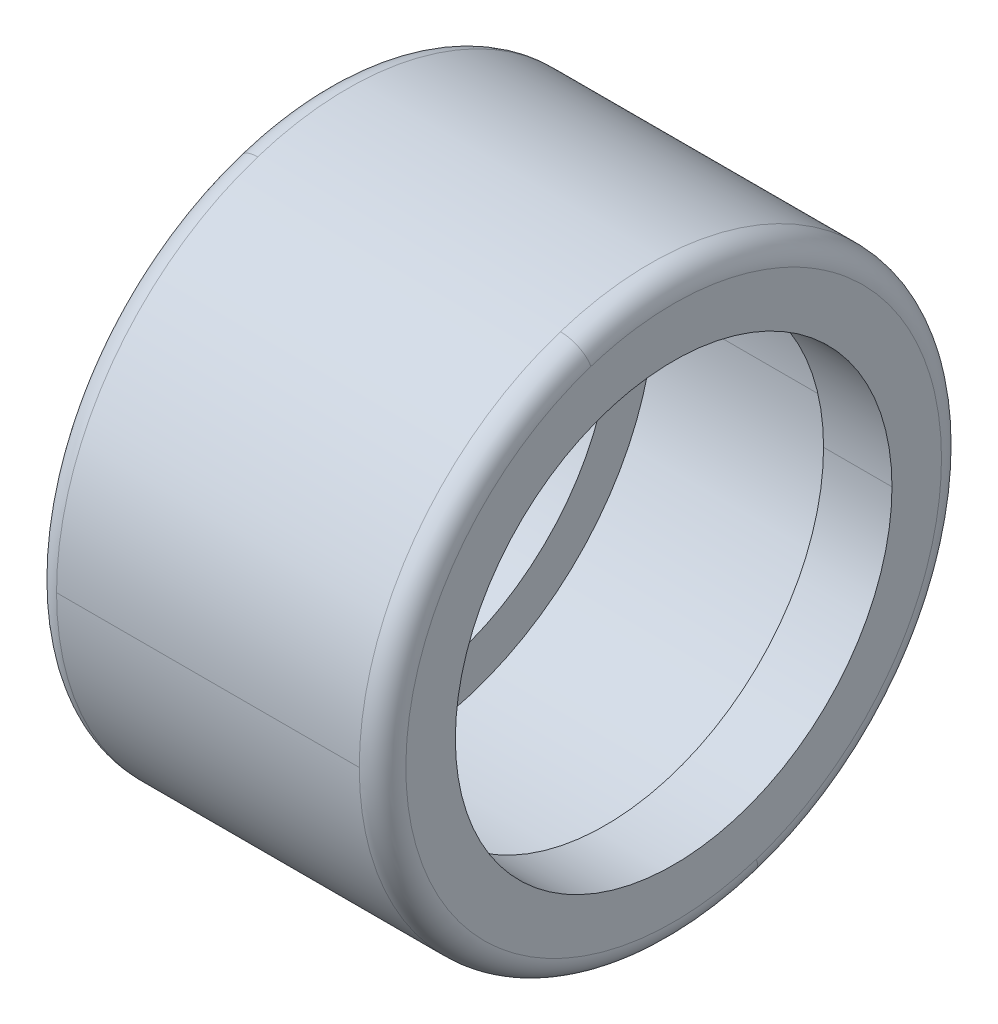
ISO-10303-21;
HEADER;
FILE_DESCRIPTION(('STEP AP214'),'2;1');
FILE_NAME('part.step','',(''),(''),'','','');
FILE_SCHEMA(('AUTOMOTIVE_DESIGN { 1 0 10303 214 1 1 1 1 }'));
ENDSEC;
DATA;
#1=APPLICATION_CONTEXT('core data for automotive mechanical design processes');
#2=APPLICATION_PROTOCOL_DEFINITION('international standard','automotive_design',2000,#1);
#3=PRODUCT_CONTEXT('',#1,'mechanical');
#4=PRODUCT('Part','Part','',(#3));
#5=PRODUCT_RELATED_PRODUCT_CATEGORY('part','',(#4));
#6=PRODUCT_DEFINITION_FORMATION('','',#4);
#7=PRODUCT_DEFINITION_CONTEXT('part definition',#1,'design');
#8=PRODUCT_DEFINITION('design','',#6,#7);
#9=PRODUCT_DEFINITION_SHAPE('','',#8);
#10=(LENGTH_UNIT() NAMED_UNIT(*) SI_UNIT(.MILLI.,.METRE.));
#11=(NAMED_UNIT(*) PLANE_ANGLE_UNIT() SI_UNIT($,.RADIAN.));
#12=(NAMED_UNIT(*) SI_UNIT($,.STERADIAN.) SOLID_ANGLE_UNIT());
#13=UNCERTAINTY_MEASURE_WITH_UNIT(LENGTH_MEASURE(1.E-05),#10,'distance_accuracy_value','');
#14=(GEOMETRIC_REPRESENTATION_CONTEXT(3) GLOBAL_UNCERTAINTY_ASSIGNED_CONTEXT((#13)) GLOBAL_UNIT_ASSIGNED_CONTEXT((#10,
#11,#12)) REPRESENTATION_CONTEXT('',''));
#15=CARTESIAN_POINT('',(0.,0.,0.));
#16=DIRECTION('',(0.,0.,1.));
#17=DIRECTION('',(1.,0.,0.));
#18=AXIS2_PLACEMENT_3D('',#15,#16,#17);
#19=CARTESIAN_POINT('',(0.80000000000006,0.,0.));
#20=DIRECTION('',(1.,0.,0.));
#21=DIRECTION('',(0.,-0.309016994374947,0.951056516295154));
#22=AXIS2_PLACEMENT_3D('',#19,#20,#21);
#23=TOROIDAL_SURFACE('',#22,9.2,0.800000000000061);
#24=CARTESIAN_POINT('',(0.80000000000006,-8.74971994991541,-2.84295634824951));
#25=DIRECTION('',(0.,0.309016994374947,-0.951056516295154));
#26=DIRECTION('',(0.,-0.951056516295154,-0.309016994374947));
#27=AXIS2_PLACEMENT_3D('',#24,#25,#26);
#28=CIRCLE('',#27,0.800000000000061);
#29=CARTESIAN_POINT('',(0.799999999999998,-9.51056516295159,-3.09016994374949));
#30=VERTEX_POINT('',#29);
#31=CARTESIAN_POINT('',(0.,-8.74971994991541,-2.84295634824951));
#32=VERTEX_POINT('',#31);
#33=EDGE_CURVE('E11',#30,#32,#28,.T.);
#34=ORIENTED_EDGE('',*,*,#33,.T.);
#35=CARTESIAN_POINT('',(0.,-8.74971994991541,-2.84295634824951));
#36=CARTESIAN_POINT('',(0.,-8.7032051754001,-2.98612443747712));
#37=CARTESIAN_POINT('',(0.,-8.65317067329749,-3.12814861219191));
#38=CARTESIAN_POINT('',(0.,-8.54619587234309,-3.40957197136774));
#39=CARTESIAN_POINT('',(0.,-8.48925557349131,-3.54897115582878));
#40=CARTESIAN_POINT('',(0.,-8.36860283746399,-3.824807373269));
#41=CARTESIAN_POINT('',(0.,-8.30489040028846,-3.96124440624817));
#42=CARTESIAN_POINT('',(0.,-8.17084781849556,-4.23082799004443));
#43=CARTESIAN_POINT('',(0.,-8.10051767387819,-4.36397454086151));
#44=CARTESIAN_POINT('',(0.,-7.95340885626128,-4.62665630268244));
#45=CARTESIAN_POINT('',(0.,-7.87663018326173,-4.75619151368629));
#46=CARTESIAN_POINT('',(0.,-7.71680934306418,-5.01133855992067));
#47=CARTESIAN_POINT('',(0.,-7.63376717586618,-5.13695039515121));
#48=CARTESIAN_POINT('',(0.,-7.46161938500327,-5.38394807303685));
#49=CARTESIAN_POINT('',(0.,-7.37251376133837,-5.50533391569195));
#50=CARTESIAN_POINT('',(0.,-7.18845372564979,-5.74358718114546));
#51=CARTESIAN_POINT('',(0.,-7.09349931362612,-5.86045460394387));
#52=CARTESIAN_POINT('',(0.,-6.89797045341445,-6.0893894853315));
#53=CARTESIAN_POINT('',(0.,-6.79739600522645,-6.20145694392072));
#54=CARTESIAN_POINT('',(0.,-6.59086936568973,-6.42052191669881));
#55=CARTESIAN_POINT('',(0.,-6.48491717434101,-6.52751943088768));
#56=CARTESIAN_POINT('',(0.,-6.2678902964987,-6.73618674844601));
#57=CARTESIAN_POINT('',(0.,-6.15681561000511,-6.83785655181546));
#58=CARTESIAN_POINT('',(0.,-5.92981133054686,-7.03562351628292));
#59=CARTESIAN_POINT('',(0.,-5.8138817375822,-7.13172067738093));
#60=CARTESIAN_POINT('',(0.,-5.57744692971877,-7.31811085082476));
#61=CARTESIAN_POINT('',(0.,-5.45694171482,-7.40840386317057));
#62=CARTESIAN_POINT('',(0.,-5.21164597070787,-7.58296821533522));
#63=CARTESIAN_POINT('',(0.,-5.0868554414945,-7.66723955515404));
#64=CARTESIAN_POINT('',(0.,-4.83328970006792,-7.82955754522561));
#65=CARTESIAN_POINT('',(0.,-4.70451448785471,-7.90760419547835));
#66=CARTESIAN_POINT('',(0.,-4.44328961119416,-8.05728478520124));
#67=CARTESIAN_POINT('',(0.,-4.31083994674682,-8.1289187246714));
#68=CARTESIAN_POINT('',(0.,-4.04258524846086,-8.26560132039455));
#69=CARTESIAN_POINT('',(0.,-3.90678021462225,-8.33064997664754));
#70=CARTESIAN_POINT('',(0.,-3.63214194377537,-8.45400529802585));
#71=CARTESIAN_POINT('',(0.,-3.49330870676711,-8.51231196315117));
#72=CARTESIAN_POINT('',(0.,-3.21294849100927,-8.6220428364108));
#73=CARTESIAN_POINT('',(0.,-3.07142151225968,-8.6734670445451));
#74=CARTESIAN_POINT('',(0.,-2.78601476390727,-8.76930911840108));
#75=CARTESIAN_POINT('',(0.,-2.64213499430445,-8.81372698412274));
#76=CARTESIAN_POINT('',(0.,-2.35236928321295,-8.89544936662436));
#77=CARTESIAN_POINT('',(0.,-2.20648334172426,-8.93275388340431));
#78=CARTESIAN_POINT('',(0.,-1.91305673887215,-9.0001596981741));
#79=CARTESIAN_POINT('',(0.,-1.76551607750873,-9.03026099616394));
#80=CARTESIAN_POINT('',(0.,-1.46913547328343,-9.08318785669006));
#81=CARTESIAN_POINT('',(0.,-1.32029553042154,-9.10601341922635));
#82=CARTESIAN_POINT('',(0.,-1.0216749316585,-9.14433382006596));
#83=CARTESIAN_POINT('',(0.,-0.871894275757341,-9.15982865836928));
#84=CARTESIAN_POINT('',(0.,-0.57175308563505,-9.18345028232027));
#85=CARTESIAN_POINT('',(0.,-0.421392551413917,-9.19157706796795));
#86=CARTESIAN_POINT('',(0.,-0.120453836348647,-9.20044300846923));
#87=CARTESIAN_POINT('',(0.,0.0301243444954906,-9.20118216332283));
#88=CARTESIAN_POINT('',(0.,0.331135596780027,-9.19527106154716));
#89=CARTESIAN_POINT('',(0.,0.481568668220426,-9.18862080491789));
#90=CARTESIAN_POINT('',(0.,0.781927295252005,-9.1679469012272));
#91=CARTESIAN_POINT('',(0.,0.931852850843185,-9.15392325416578));
#92=CARTESIAN_POINT('',(0.,1.23083526238098,-9.11853635380487));
#93=CARTESIAN_POINT('',(0.,1.37989211832759,-9.09717310050539));
#94=CARTESIAN_POINT('',(0.,1.67677803955444,-9.04715845361677));
#95=CARTESIAN_POINT('',(0.,1.82460710483467,-9.01850706002764));
#96=CARTESIAN_POINT('',(0.,2.11868131156221,-8.95398515627642));
#97=CARTESIAN_POINT('',(0.,2.26492645300951,-8.91811464611435));
#98=CARTESIAN_POINT('',(0.,2.55548049471585,-8.83924092441813));
#99=CARTESIAN_POINT('',(0.,2.69978939497491,-8.79623771288399));
#100=CARTESIAN_POINT('',(0.,2.98612330152407,-8.70320218694685));
#101=CARTESIAN_POINT('',(0.,3.12814830781419,-8.65316987254386));
#102=CARTESIAN_POINT('',(0.,3.40957227574541,-8.54619667309674));
#103=CARTESIAN_POINT('',(0.,3.54897123738652,-8.48925578805261));
#104=CARTESIAN_POINT('',(0.,3.82480729171122,-8.36860262290271));
#105=CARTESIAN_POINT('',(0.,3.96124438439482,-8.30489034279695));
#106=CARTESIAN_POINT('',(0.,4.23082801189774,-8.17084787598709));
#107=CARTESIAN_POINT('',(0.,4.36397454671708,-8.10051768928301));
#108=CARTESIAN_POINT('',(0.,4.62665629682684,-7.95340884085648));
#109=CARTESIAN_POINT('',(0.,4.75619151211727,-7.87663017913404));
#110=CARTESIAN_POINT('',(0.,5.01133856148965,-7.7168093471919));
#111=CARTESIAN_POINT('',(0.,5.1369503955716,-7.63376717697221));
#112=CARTESIAN_POINT('',(0.,5.38394807261641,-7.46161938389727));
#113=CARTESIAN_POINT('',(0.,5.50533391557928,-7.37251376104202));
#114=CARTESIAN_POINT('',(0.,5.74358718125809,-7.18845372594616));
#115=CARTESIAN_POINT('',(0.,5.86045460397403,-7.09349931370554));
#116=CARTESIAN_POINT('',(0.,6.08938948530129,-6.89797045333506));
#117=CARTESIAN_POINT('',(0.,6.20145694391261,-6.79739600520519));
#118=CARTESIAN_POINT('',(0.,6.42052191670688,-6.59086936571103));
#119=CARTESIAN_POINT('',(0.,6.52751943088983,-6.48491717434673));
#120=CARTESIAN_POINT('',(0.,6.73618674844382,-6.26789029649302));
#121=CARTESIAN_POINT('',(0.,6.83785655181486,-6.1568156100036));
#122=CARTESIAN_POINT('',(0.,7.03562351628349,-5.92981133054841));
#123=CARTESIAN_POINT('',(0.,7.13172067738107,-5.81388173758262));
#124=CARTESIAN_POINT('',(0.,7.31811085082458,-5.57744692971838));
#125=CARTESIAN_POINT('',(0.,7.40840386317051,-5.45694171481991));
#126=CARTESIAN_POINT('',(0.,7.58296821533524,-5.211645970708));
#127=CARTESIAN_POINT('',(0.,7.66723955515404,-5.08685544149455));
#128=CARTESIAN_POINT('',(0.,7.82955754522558,-4.83328970006792));
#129=CARTESIAN_POINT('',(0.,7.90760419547833,-4.70451448785472));
#130=CARTESIAN_POINT('',(0.,8.05728478520123,-4.44328961119419));
#131=CARTESIAN_POINT('',(0.,8.12891872467139,-4.31083994674684));
#132=CARTESIAN_POINT('',(0.,8.26560132039454,-4.04258524846088));
#133=CARTESIAN_POINT('',(0.,8.33064997664752,-3.90678021462227));
#134=CARTESIAN_POINT('',(0.,8.45400529802585,-3.63214194377539));
#135=CARTESIAN_POINT('',(0.,8.51231196315119,-3.49330870676713));
#136=CARTESIAN_POINT('',(0.,8.62204283641076,-3.2129484910093));
#137=CARTESIAN_POINT('',(0.,8.67346704454498,-3.07142151225973));
#138=CARTESIAN_POINT('',(0.,8.76930911840118,-2.78601476390726));
#139=CARTESIAN_POINT('',(0.,8.81372698412315,-2.64213499430436));
#140=CARTESIAN_POINT('',(0.,8.89544936662393,-2.35236928321308));
#141=CARTESIAN_POINT('',(0.,8.93275388340273,-2.20648334172471));
#142=CARTESIAN_POINT('',(0.,9.00015969817567,-1.91305673887175));
#143=CARTESIAN_POINT('',(0.,9.03026099616982,-1.76551607750716));
#144=CARTESIAN_POINT('',(0.,9.08318785668417,-1.46913547328505));
#145=CARTESIAN_POINT('',(0.,9.10601341920438,-1.32029553042753));
#146=CARTESIAN_POINT('',(0.,9.14433382008792,-1.02167493165256));
#147=CARTESIAN_POINT('',(0.,9.15982865845126,-0.871894275735111));
#148=CARTESIAN_POINT('',(0.,9.18345028223829,-0.571753085657331));
#149=CARTESIAN_POINT('',(0.,9.19157706766198,-0.421392551497003));
#150=CARTESIAN_POINT('',(0.,9.2004430087752,-0.120453836265618));
#151=CARTESIAN_POINT('',(0.,9.20118216446473,0.0301243448054401));
#152=CARTESIAN_POINT('',(0.,9.19527106040526,0.331135596470018));
#153=CARTESIAN_POINT('',(0.,9.18862080065627,0.481568667063538));
#154=CARTESIAN_POINT('',(0.,9.16794690548882,0.781927296408833));
#155=CARTESIAN_POINT('',(0.,9.15392327007035,0.931852855160607));
#156=CARTESIAN_POINT('',(0.,9.1185363379003,1.2308352580635));
#157=CARTESIAN_POINT('',(0.,9.09717304114871,1.37989210221462));
#158=CARTESIAN_POINT('',(0.,9.04715851297347,1.67677805566737));
#159=CARTESIAN_POINT('',(0.,9.01850728154982,1.824607164969));
#160=CARTESIAN_POINT('',(0.,8.95398493475425,2.11868125142783));
#161=CARTESIAN_POINT('',(0.,8.91811381938233,2.26492622858503));
#162=CARTESIAN_POINT('',(0.,8.83924175115016,2.55548071914028));
#163=CARTESIAN_POINT('',(0.,8.7962407982899,2.69979023253834));
#164=CARTESIAN_POINT('',(0.,8.74971994991543,2.84295634824947));
#165=B_SPLINE_CURVE_WITH_KNOTS('',3,(#35,#36,#37,#38,#39,#40,#41,#42,#43,#44,#45,#46,#47,#48,
#49,#50,#51,#52,#53,#54,#55,#56,#57,#58,#59,#60,#61,#62,#63,#64,#65,#66,#67,#68,#69,#70,#71,#72,
#73,#74,#75,#76,#77,#78,#79,#80,#81,#82,#83,#84,#85,#86,#87,#88,#89,#90,#91,#92,#93,#94,#95,#96,
#97,#98,#99,#100,#101,#102,#103,#104,#105,#106,#107,#108,#109,#110,#111,#112,#113,#114,#115,
#116,#117,#118,#119,#120,#121,#122,#123,#124,#125,#126,#127,#128,#129,#130,#131,#132,#133,#134,
#135,#136,#137,#138,#139,#140,#141,#142,#143,#144,#145,#146,#147,#148,#149,#150,#151,#152,#153,
#154,#155,#156,#157,#158,#159,#160,#161,#162,#163,#164),.UNSPECIFIED.,.F.,.F.,(4,2,2,2,2,2,2,2,
2,2,2,2,2,2,2,2,2,2,2,2,2,2,2,2,2,2,2,2,2,2,2,2,2,2,2,2,2,2,2,2,2,2,2,2,2,2,2,2,2,2,2,2,2,2,2,2,
2,2,2,2,2,2,2,2,4),(0.,0.451558604821586,0.903117209643169,1.35467581446475,1.80623441928634,
2.25779302410793,2.70935162892951,3.1609102337511,3.61246883857268,4.06402744339427,
4.51558604821585,4.96714465303744,5.41870325785902,5.87026186268061,6.32182046750219,
6.77337907232378,7.22493767714536,7.67649628196695,8.12805488678854,8.57961349161012,
9.03117209643171,9.48273070125329,9.93428930607488,10.3858479108965,10.837406515718,
11.2889651205396,11.7405237253612,12.1920823301828,12.6436409350044,13.095199539826,
13.5467581446476,13.9983167494691,14.4498753542907,14.9014339591123,15.3529925639339,
15.8045511687555,16.2561097735771,16.7076683783987,17.1592269832202,17.6107855880418,
18.0623441928634,18.513902797685,18.9654614025066,19.4170200073282,19.8685786121498,
20.3201372169713,20.7716958217929,21.2232544266145,21.6748130314361,22.1263716362577,
22.5779302410793,23.0294888459008,23.4810474507224,23.932606055544,24.3841646603656,
24.8357232651872,25.2872818700088,25.7388404748303,26.1903990796519,26.6419576844735,
27.0935162892951,27.5450748941167,27.9966334989383,28.4481921037599,28.8997507085814),.UNSPECIFIED.);
#166=CARTESIAN_POINT('',(0.,8.74971994991541,2.84295634824951));
#167=VERTEX_POINT('',#166);
#168=EDGE_CURVE('E26',#32,#167,#165,.T.);
#169=ORIENTED_EDGE('',*,*,#168,.T.);
#170=CARTESIAN_POINT('',(0.80000000000006,8.74971994991541,2.84295634824952));
#171=DIRECTION('',(0.,-0.309016994374948,0.951056516295154));
#172=DIRECTION('',(0.,0.951056516295154,0.309016994374948));
#173=AXIS2_PLACEMENT_3D('',#170,#171,#172);
#174=CIRCLE('',#173,0.800000000000061);
#175=CARTESIAN_POINT('',(0.799999999999998,9.51056516295159,3.09016994374949));
#176=VERTEX_POINT('',#175);
#177=EDGE_CURVE('E298',#176,#167,#174,.T.);
#178=ORIENTED_EDGE('',*,*,#177,.F.);
#179=CARTESIAN_POINT('',(0.8,0.,0.));
#180=DIRECTION('',(1.,0.,0.));
#181=DIRECTION('',(0.,0.,-1.));
#182=AXIS2_PLACEMENT_3D('',#179,#180,#181);
#183=CIRCLE('',#182,10.);
#184=CARTESIAN_POINT('',(0.8,0.,-10.));
#185=VERTEX_POINT('',#184);
#186=EDGE_CURVE('E293',#185,#176,#183,.T.);
#187=ORIENTED_EDGE('',*,*,#186,.F.);
#188=CARTESIAN_POINT('',(0.8,0.,0.));
#189=DIRECTION('',(1.,0.,0.));
#190=DIRECTION('',(0.,0.,-1.));
#191=AXIS2_PLACEMENT_3D('',#188,#189,#190);
#192=CIRCLE('',#191,10.);
#193=EDGE_CURVE('E288',#30,#185,#192,.T.);
#194=ORIENTED_EDGE('',*,*,#193,.F.);
#195=EDGE_LOOP('',(#34,#169,#178,#187,#194));
#196=FACE_BOUND('',#195,.T.);
#197=ADVANCED_FACE('F17',(#196),#23,.T.);
#198=CARTESIAN_POINT('',(50.,0.,0.));
#199=DIRECTION('',(1.,0.,0.));
#200=DIRECTION('',(0.,1.,0.));
#201=AXIS2_PLACEMENT_3D('',#198,#199,#200);
#202=CYLINDRICAL_SURFACE('',#201,10.);
#203=DIRECTION('',(1.,0.,0.));
#204=VECTOR('',#203,1.);
#205=CARTESIAN_POINT('',(0.799999999999997,0.,10.));
#206=LINE('',#205,#204);
#207=CARTESIAN_POINT('',(0.799999999999997,0.,10.));
#208=VERTEX_POINT('',#207);
#209=CARTESIAN_POINT('',(11.2,0.,10.));
#210=VERTEX_POINT('',#209);
#211=EDGE_CURVE('E283',#208,#210,#206,.T.);
#212=ORIENTED_EDGE('',*,*,#211,.F.);
#213=CARTESIAN_POINT('',(0.8,0.,0.));
#214=DIRECTION('',(1.,0.,0.));
#215=DIRECTION('',(0.,0.,-1.));
#216=AXIS2_PLACEMENT_3D('',#213,#214,#215);
#217=CIRCLE('',#216,10.);
#218=EDGE_CURVE('E278',#208,#30,#217,.T.);
#219=ORIENTED_EDGE('',*,*,#218,.T.);
#220=ORIENTED_EDGE('',*,*,#193,.T.);
#221=DIRECTION('',(1.,0.,0.));
#222=VECTOR('',#221,1.);
#223=CARTESIAN_POINT('',(0.799999999999997,0.,-10.));
#224=LINE('',#223,#222);
#225=CARTESIAN_POINT('',(11.2,0.,-10.));
#226=VERTEX_POINT('',#225);
#227=EDGE_CURVE('E274',#185,#226,#224,.T.);
#228=ORIENTED_EDGE('',*,*,#227,.T.);
#229=CARTESIAN_POINT('',(11.2,0.,0.));
#230=DIRECTION('',(1.,0.,0.));
#231=DIRECTION('',(0.,0.,-1.));
#232=AXIS2_PLACEMENT_3D('',#229,#230,#231);
#233=CIRCLE('',#232,10.);
#234=CARTESIAN_POINT('',(11.2,-9.51056516295154,-3.09016994374947));
#235=VERTEX_POINT('',#234);
#236=EDGE_CURVE('E269',#235,#226,#233,.T.);
#237=ORIENTED_EDGE('',*,*,#236,.F.);
#238=CARTESIAN_POINT('',(11.2,0.,0.));
#239=DIRECTION('',(1.,0.,0.));
#240=DIRECTION('',(0.,0.,-1.));
#241=AXIS2_PLACEMENT_3D('',#238,#239,#240);
#242=CIRCLE('',#241,10.);
#243=EDGE_CURVE('E264',#210,#235,#242,.T.);
#244=ORIENTED_EDGE('',*,*,#243,.F.);
#245=EDGE_LOOP('',(#212,#219,#220,#228,#237,#244));
#246=FACE_BOUND('',#245,.T.);
#247=ADVANCED_FACE('F316',(#246),#202,.T.);
#248=CARTESIAN_POINT('',(11.1999999999995,0.,0.));
#249=DIRECTION('',(1.,0.,0.));
#250=DIRECTION('',(0.,0.309016994374947,-0.951056516295154));
#251=AXIS2_PLACEMENT_3D('',#248,#249,#250);
#252=TOROIDAL_SURFACE('',#251,9.19999999999953,0.800000000000471);
#253=CARTESIAN_POINT('',(11.1999999999995,-8.74971994991497,-2.84295634824937));
#254=DIRECTION('',(0.,0.309016994374947,-0.951056516295154));
#255=DIRECTION('',(1.,0.,0.));
#256=AXIS2_PLACEMENT_3D('',#253,#254,#255);
#257=CIRCLE('',#256,0.800000000000471);
#258=CARTESIAN_POINT('',(12.,-8.74971994991497,-2.84295634824937));
#259=VERTEX_POINT('',#258);
#260=EDGE_CURVE('E259',#259,#235,#257,.T.);
#261=ORIENTED_EDGE('',*,*,#260,.F.);
#262=CARTESIAN_POINT('',(12.,0.,0.));
#263=DIRECTION('',(1.,0.,0.));
#264=DIRECTION('',(0.,0.,-1.));
#265=AXIS2_PLACEMENT_3D('',#262,#263,#264);
#266=CIRCLE('',#265,9.2);
#267=CARTESIAN_POINT('',(12.,8.74971994991497,2.84295634824937));
#268=VERTEX_POINT('',#267);
#269=EDGE_CURVE('E254',#268,#259,#266,.T.);
#270=ORIENTED_EDGE('',*,*,#269,.F.);
#271=CARTESIAN_POINT('',(11.1999999999995,8.74971994991497,2.84295634824937));
#272=DIRECTION('',(0.,-0.309016994374947,0.951056516295154));
#273=DIRECTION('',(1.,0.,0.));
#274=AXIS2_PLACEMENT_3D('',#271,#272,#273);
#275=CIRCLE('',#274,0.800000000000471);
#276=CARTESIAN_POINT('',(11.2,9.51056516295154,3.09016994374947));
#277=VERTEX_POINT('',#276);
#278=EDGE_CURVE('E250',#268,#277,#275,.T.);
#279=ORIENTED_EDGE('',*,*,#278,.T.);
#280=CARTESIAN_POINT('',(11.2,0.,0.));
#281=DIRECTION('',(1.,0.,0.));
#282=DIRECTION('',(0.,0.,-1.));
#283=AXIS2_PLACEMENT_3D('',#280,#281,#282);
#284=CIRCLE('',#283,10.);
#285=EDGE_CURVE('E245',#277,#210,#284,.T.);
#286=ORIENTED_EDGE('',*,*,#285,.T.);
#287=ORIENTED_EDGE('',*,*,#243,.T.);
#288=EDGE_LOOP('',(#261,#270,#279,#286,#287));
#289=FACE_BOUND('',#288,.T.);
#290=ADVANCED_FACE('F325',(#289),#252,.T.);
#291=CARTESIAN_POINT('',(50.,0.,0.));
#292=DIRECTION('',(1.,0.,0.));
#293=DIRECTION('',(0.,-1.,0.));
#294=AXIS2_PLACEMENT_3D('',#291,#292,#293);
#295=CYLINDRICAL_SURFACE('',#294,10.);
#296=ORIENTED_EDGE('',*,*,#211,.T.);
#297=ORIENTED_EDGE('',*,*,#285,.F.);
#298=CARTESIAN_POINT('',(11.2,0.,0.));
#299=DIRECTION('',(1.,0.,0.));
#300=DIRECTION('',(0.,0.,-1.));
#301=AXIS2_PLACEMENT_3D('',#298,#299,#300);
#302=CIRCLE('',#301,10.);
#303=EDGE_CURVE('E240',#226,#277,#302,.T.);
#304=ORIENTED_EDGE('',*,*,#303,.F.);
#305=ORIENTED_EDGE('',*,*,#227,.F.);
#306=ORIENTED_EDGE('',*,*,#186,.T.);
#307=CARTESIAN_POINT('',(0.8,0.,0.));
#308=DIRECTION('',(1.,0.,0.));
#309=DIRECTION('',(0.,0.,-1.));
#310=AXIS2_PLACEMENT_3D('',#307,#308,#309);
#311=CIRCLE('',#310,10.);
#312=EDGE_CURVE('E237',#176,#208,#311,.T.);
#313=ORIENTED_EDGE('',*,*,#312,.T.);
#314=EDGE_LOOP('',(#296,#297,#304,#305,#306,#313));
#315=FACE_BOUND('',#314,.T.);
#316=ADVANCED_FACE('F318',(#315),#295,.T.);
#317=CARTESIAN_POINT('',(0.80000000000006,0.,0.));
#318=DIRECTION('',(1.,0.,0.));
#319=DIRECTION('',(0.,0.309016994374947,-0.951056516295154));
#320=AXIS2_PLACEMENT_3D('',#317,#318,#319);
#321=TOROIDAL_SURFACE('',#320,9.2,0.800000000000061);
#322=ORIENTED_EDGE('',*,*,#33,.F.);
#323=ORIENTED_EDGE('',*,*,#218,.F.);
#324=ORIENTED_EDGE('',*,*,#312,.F.);
#325=ORIENTED_EDGE('',*,*,#177,.T.);
#326=CARTESIAN_POINT('',(0.,8.74971994991541,2.84295634824952));
#327=CARTESIAN_POINT('',(0.,8.7032051754001,2.98612443747712));
#328=CARTESIAN_POINT('',(0.,8.65317067329749,3.12814861219191));
#329=CARTESIAN_POINT('',(0.,8.54619587234309,3.40957197136774));
#330=CARTESIAN_POINT('',(0.,8.48925557349131,3.54897115582879));
#331=CARTESIAN_POINT('',(0.,8.36860283746399,3.824807373269));
#332=CARTESIAN_POINT('',(0.,8.30489040028846,3.96124440624818));
#333=CARTESIAN_POINT('',(0.,8.17084781849556,4.23082799004443));
#334=CARTESIAN_POINT('',(0.,8.10051767387819,4.36397454086152));
#335=CARTESIAN_POINT('',(0.,7.95340885626128,4.62665630268245));
#336=CARTESIAN_POINT('',(0.,7.87663018326173,4.75619151368629));
#337=CARTESIAN_POINT('',(0.,7.71680934306418,5.01133855992067));
#338=CARTESIAN_POINT('',(0.,7.63376717586618,5.13695039515121));
#339=CARTESIAN_POINT('',(0.,7.46161938500327,5.38394807303685));
#340=CARTESIAN_POINT('',(0.,7.37251376133836,5.50533391569195));
#341=CARTESIAN_POINT('',(0.,7.18845372564979,5.74358718114546));
#342=CARTESIAN_POINT('',(0.,7.09349931362612,5.86045460394387));
#343=CARTESIAN_POINT('',(0.,6.89797045341445,6.0893894853315));
#344=CARTESIAN_POINT('',(0.,6.79739600522645,6.20145694392072));
#345=CARTESIAN_POINT('',(0.,6.59086936568973,6.42052191669882));
#346=CARTESIAN_POINT('',(0.,6.48491717434101,6.52751943088769));
#347=CARTESIAN_POINT('',(0.,6.2678902964987,6.73618674844601));
#348=CARTESIAN_POINT('',(0.,6.15681561000511,6.83785655181546));
#349=CARTESIAN_POINT('',(0.,5.92981133054686,7.03562351628293));
#350=CARTESIAN_POINT('',(0.,5.81388173758219,7.13172067738094));
#351=CARTESIAN_POINT('',(0.,5.57744692971876,7.31811085082476));
#352=CARTESIAN_POINT('',(0.,5.45694171482,7.40840386317057));
#353=CARTESIAN_POINT('',(0.,5.21164597070787,7.58296821533522));
#354=CARTESIAN_POINT('',(0.,5.0868554414945,7.66723955515405));
#355=CARTESIAN_POINT('',(0.,4.83328970006792,7.82955754522561));
#356=CARTESIAN_POINT('',(0.,4.7045144878547,7.90760419547835));
#357=CARTESIAN_POINT('',(0.,4.44328961119415,8.05728478520125));
#358=CARTESIAN_POINT('',(0.,4.31083994674682,8.1289187246714));
#359=CARTESIAN_POINT('',(0.,4.04258524846086,8.26560132039455));
#360=CARTESIAN_POINT('',(0.,3.90678021462224,8.33064997664754));
#361=CARTESIAN_POINT('',(0.,3.63214194377537,8.45400529802585));
#362=CARTESIAN_POINT('',(0.,3.49330870676711,8.51231196315118));
#363=CARTESIAN_POINT('',(0.,3.21294849100926,8.6220428364108));
#364=CARTESIAN_POINT('',(0.,3.07142151225967,8.67346704454511));
#365=CARTESIAN_POINT('',(0.,2.78601476390726,8.76930911840108));
#366=CARTESIAN_POINT('',(0.,2.64213499430445,8.81372698412274));
#367=CARTESIAN_POINT('',(0.,2.35236928321294,8.89544936662436));
#368=CARTESIAN_POINT('',(0.,2.20648334172425,8.93275388340431));
#369=CARTESIAN_POINT('',(0.,1.91305673887214,9.0001596981741));
#370=CARTESIAN_POINT('',(0.,1.76551607750872,9.03026099616394));
#371=CARTESIAN_POINT('',(0.,1.46913547328342,9.08318785669006));
#372=CARTESIAN_POINT('',(0.,1.32029553042154,9.10601341922635));
#373=CARTESIAN_POINT('',(0.,1.02167493165849,9.14433382006596));
#374=CARTESIAN_POINT('',(0.,0.871894275757333,9.15982865836928));
#375=CARTESIAN_POINT('',(0.,0.571753085635041,9.18345028232027));
#376=CARTESIAN_POINT('',(0.,0.421392551413908,9.19157706796796));
#377=CARTESIAN_POINT('',(0.,0.120453836348639,9.20044300846923));
#378=CARTESIAN_POINT('',(0.,-0.0301243444954969,9.20118216332283));
#379=CARTESIAN_POINT('',(0.,-0.331135596780033,9.19527106154716));
#380=CARTESIAN_POINT('',(0.,-0.481568668220434,9.18862080491789));
#381=CARTESIAN_POINT('',(0.,-0.781927295252014,9.1679469012272));
#382=CARTESIAN_POINT('',(0.,-0.931852850843193,9.15392325416577));
#383=CARTESIAN_POINT('',(0.,-1.23083526238099,9.11853635380487));
#384=CARTESIAN_POINT('',(0.,-1.3798921183276,9.09717310050539));
#385=CARTESIAN_POINT('',(0.,-1.67677803955445,9.04715845361677));
#386=CARTESIAN_POINT('',(0.,-1.82460710483469,9.01850706002763));
#387=CARTESIAN_POINT('',(0.,-2.11868131156222,8.95398515627642));
#388=CARTESIAN_POINT('',(0.,-2.26492645300951,8.91811464611435));
#389=CARTESIAN_POINT('',(0.,-2.55548049471586,8.83924092441813));
#390=CARTESIAN_POINT('',(0.,-2.69978939497491,8.79623771288398));
#391=CARTESIAN_POINT('',(0.,-2.98612330152408,8.70320218694685));
#392=CARTESIAN_POINT('',(0.,-3.1281483078142,8.65316987254386));
#393=CARTESIAN_POINT('',(0.,-3.40957227574542,8.54619667309674));
#394=CARTESIAN_POINT('',(0.,-3.54897123738653,8.4892557880526));
#395=CARTESIAN_POINT('',(0.,-3.82480729171123,8.36860262290271));
#396=CARTESIAN_POINT('',(0.,-3.96124438439482,8.30489034279695));
#397=CARTESIAN_POINT('',(0.,-4.23082801189775,8.1708478759871));
#398=CARTESIAN_POINT('',(0.,-4.36397454671709,8.10051768928301));
#399=CARTESIAN_POINT('',(0.,-4.62665629682685,7.95340884085648));
#400=CARTESIAN_POINT('',(0.,-4.75619151211728,7.87663017913404));
#401=CARTESIAN_POINT('',(0.,-5.01133856148966,7.7168093471919));
#402=CARTESIAN_POINT('',(0.,-5.13695039557161,7.63376717697221));
#403=CARTESIAN_POINT('',(0.,-5.38394807261642,7.46161938389726));
#404=CARTESIAN_POINT('',(0.,-5.50533391557929,7.37251376104202));
#405=CARTESIAN_POINT('',(0.,-5.7435871812581,7.18845372594615));
#406=CARTESIAN_POINT('',(0.,-5.86045460397404,7.09349931370554));
#407=CARTESIAN_POINT('',(0.,-6.0893894853013,6.89797045333505));
#408=CARTESIAN_POINT('',(0.,-6.20145694391262,6.79739600520519));
#409=CARTESIAN_POINT('',(0.,-6.42052191670689,6.59086936571102));
#410=CARTESIAN_POINT('',(0.,-6.52751943088984,6.48491717434672));
#411=CARTESIAN_POINT('',(0.,-6.73618674844383,6.26789029649301));
#412=CARTESIAN_POINT('',(0.,-6.83785655181487,6.15681561000359));
#413=CARTESIAN_POINT('',(0.,-7.0356235162835,5.92981133054839));
#414=CARTESIAN_POINT('',(0.,-7.13172067738108,5.81388173758261));
#415=CARTESIAN_POINT('',(0.,-7.31811085082459,5.57744692971837));
#416=CARTESIAN_POINT('',(0.,-7.40840386317052,5.4569417148199));
#417=CARTESIAN_POINT('',(0.,-7.58296821533525,5.21164597070799));
#418=CARTESIAN_POINT('',(0.,-7.66723955515405,5.08685544149454));
#419=CARTESIAN_POINT('',(0.,-7.82955754522559,4.8332897000679));
#420=CARTESIAN_POINT('',(0.,-7.90760419547834,4.70451448785471));
#421=CARTESIAN_POINT('',(0.,-8.05728478520124,4.44328961119418));
#422=CARTESIAN_POINT('',(0.,-8.1289187246714,4.31083994674683));
#423=CARTESIAN_POINT('',(0.,-8.26560132039454,4.04258524846087));
#424=CARTESIAN_POINT('',(0.,-8.33064997664753,3.90678021462226));
#425=CARTESIAN_POINT('',(0.,-8.45400529802586,3.63214194377538));
#426=CARTESIAN_POINT('',(0.,-8.5123119631512,3.49330870676711));
#427=CARTESIAN_POINT('',(0.,-8.62204283641077,3.21294849100928));
#428=CARTESIAN_POINT('',(0.,-8.67346704454499,3.07142151225972));
#429=CARTESIAN_POINT('',(0.,-8.76930911840118,2.78601476390725));
#430=CARTESIAN_POINT('',(0.,-8.81372698412316,2.64213499430435));
#431=CARTESIAN_POINT('',(0.,-8.89544936662393,2.35236928321307));
#432=CARTESIAN_POINT('',(0.,-8.93275388340273,2.2064833417247));
#433=CARTESIAN_POINT('',(0.,-9.00015969817568,1.91305673887173));
#434=CARTESIAN_POINT('',(0.,-9.03026099616982,1.76551607750714));
#435=CARTESIAN_POINT('',(0.,-9.08318785668417,1.46913547328504));
#436=CARTESIAN_POINT('',(0.,-9.10601341920438,1.32029553042752));
#437=CARTESIAN_POINT('',(0.,-9.14433382008793,1.02167493165255));
#438=CARTESIAN_POINT('',(0.,-9.15982865845126,0.871894275735096));
#439=CARTESIAN_POINT('',(0.,-9.18345028223829,0.571753085657314));
#440=CARTESIAN_POINT('',(0.,-9.19157706766198,0.421392551496986));
#441=CARTESIAN_POINT('',(0.,-9.2004430087752,0.1204538362656));
#442=CARTESIAN_POINT('',(0.,-9.20118216446473,-0.0301243448054577));
#443=CARTESIAN_POINT('',(0.,-9.19527106040526,-0.331135596470036));
#444=CARTESIAN_POINT('',(0.,-9.18862080065627,-0.481568667063556));
#445=CARTESIAN_POINT('',(0.,-9.16794690548881,-0.781927296408851));
#446=CARTESIAN_POINT('',(0.,-9.15392327007035,-0.931852855160625));
#447=CARTESIAN_POINT('',(0.,-9.1185363379003,-1.23083525806351));
#448=CARTESIAN_POINT('',(0.,-9.0971730411487,-1.37989210221463));
#449=CARTESIAN_POINT('',(0.,-9.04715851297346,-1.67677805566738));
#450=CARTESIAN_POINT('',(0.,-9.01850728154981,-1.82460716496901));
#451=CARTESIAN_POINT('',(0.,-8.95398493475425,-2.11868125142784));
#452=CARTESIAN_POINT('',(0.,-8.91811381938233,-2.26492622858504));
#453=CARTESIAN_POINT('',(0.,-8.83924175115015,-2.55548071914029));
#454=CARTESIAN_POINT('',(0.,-8.79624079828989,-2.69979023253835));
#455=CARTESIAN_POINT('',(0.,-8.74971994991542,-2.84295634824948));
#456=B_SPLINE_CURVE_WITH_KNOTS('',3,(#326,#327,#328,#329,#330,#331,#332,#333,#334,#335,#336,
#337,#338,#339,#340,#341,#342,#343,#344,#345,#346,#347,#348,#349,#350,#351,#352,#353,#354,#355,
#356,#357,#358,#359,#360,#361,#362,#363,#364,#365,#366,#367,#368,#369,#370,#371,#372,#373,#374,
#375,#376,#377,#378,#379,#380,#381,#382,#383,#384,#385,#386,#387,#388,#389,#390,#391,#392,#393,
#394,#395,#396,#397,#398,#399,#400,#401,#402,#403,#404,#405,#406,#407,#408,#409,#410,#411,#412,
#413,#414,#415,#416,#417,#418,#419,#420,#421,#422,#423,#424,#425,#426,#427,#428,#429,#430,#431,
#432,#433,#434,#435,#436,#437,#438,#439,#440,#441,#442,#443,#444,#445,#446,#447,#448,#449,#450,
#451,#452,#453,#454,#455),.UNSPECIFIED.,.F.,.F.,(4,2,2,2,2,2,2,2,2,2,2,2,2,2,2,2,2,2,2,2,2,2,2,
2,2,2,2,2,2,2,2,2,2,2,2,2,2,2,2,2,2,2,2,2,2,2,2,2,2,2,2,2,2,2,2,2,2,2,2,2,2,2,2,2,4),(0.,
0.451558604821586,0.90311720964317,1.35467581446476,1.80623441928634,2.25779302410793,
2.70935162892951,3.1609102337511,3.61246883857268,4.06402744339427,4.51558604821585,
4.96714465303744,5.41870325785903,5.87026186268061,6.3218204675022,6.77337907232378,
7.22493767714537,7.67649628196695,8.12805488678854,8.57961349161013,9.03117209643171,
9.4827307012533,9.93428930607488,10.3858479108965,10.8374065157181,11.2889651205396,
11.7405237253612,12.1920823301828,12.6436409350044,13.095199539826,13.5467581446476,
13.9983167494692,14.4498753542907,14.9014339591123,15.3529925639339,15.8045511687555,
16.2561097735771,16.7076683783987,17.1592269832203,17.6107855880418,18.0623441928634,
18.513902797685,18.9654614025066,19.4170200073282,19.8685786121498,20.3201372169714,
20.7716958217929,21.2232544266145,21.6748130314361,22.1263716362577,22.5779302410793,
23.0294888459009,23.4810474507224,23.932606055544,24.3841646603656,24.8357232651872,
25.2872818700088,25.7388404748304,26.190399079652,26.6419576844735,27.0935162892951,
27.5450748941167,27.9966334989383,28.4481921037599,28.8997507085815),.UNSPECIFIED.);
#457=EDGE_CURVE('E223',#167,#32,#456,.T.);
#458=ORIENTED_EDGE('',*,*,#457,.T.);
#459=EDGE_LOOP('',(#322,#323,#324,#325,#458));
#460=FACE_BOUND('',#459,.T.);
#461=ADVANCED_FACE('F202',(#460),#321,.T.);
#462=CARTESIAN_POINT('',(0.,9.2,0.));
#463=DIRECTION('',(-1.,0.,0.));
#464=DIRECTION('',(0.,0.,1.));
#465=AXIS2_PLACEMENT_3D('',#462,#463,#464);
#466=PLANE('',#465);
#467=CARTESIAN_POINT('',(0.,0.,0.));
#468=DIRECTION('',(1.,0.,0.));
#469=DIRECTION('',(0.,0.,-1.));
#470=AXIS2_PLACEMENT_3D('',#467,#468,#469);
#471=CIRCLE('',#470,7.5);
#472=CARTESIAN_POINT('',(0.,0.,-7.5));
#473=VERTEX_POINT('',#472);
#474=CARTESIAN_POINT('',(0.,0.,7.5));
#475=VERTEX_POINT('',#474);
#476=EDGE_CURVE('E219',#473,#475,#471,.T.);
#477=ORIENTED_EDGE('',*,*,#476,.T.);
#478=CARTESIAN_POINT('',(0.,0.,0.));
#479=DIRECTION('',(1.,0.,0.));
#480=DIRECTION('',(0.,0.,-1.));
#481=AXIS2_PLACEMENT_3D('',#478,#479,#480);
#482=CIRCLE('',#481,7.5);
#483=EDGE_CURVE('E183',#475,#473,#482,.T.);
#484=ORIENTED_EDGE('',*,*,#483,.T.);
#485=EDGE_LOOP('',(#477,#484));
#486=FACE_BOUND('',#485,.T.);
#487=ORIENTED_EDGE('',*,*,#168,.F.);
#488=ORIENTED_EDGE('',*,*,#457,.F.);
#489=EDGE_LOOP('',(#487,#488));
#490=FACE_BOUND('',#489,.T.);
#491=ADVANCED_FACE('F191',(#486,#490),#466,.T.);
#492=CARTESIAN_POINT('',(50.,0.,0.));
#493=DIRECTION('',(1.,0.,0.));
#494=DIRECTION('',(0.,1.,0.));
#495=AXIS2_PLACEMENT_3D('',#492,#493,#494);
#496=CYLINDRICAL_SURFACE('',#495,7.5);
#497=DIRECTION('',(1.,0.,0.));
#498=VECTOR('',#497,1.);
#499=CARTESIAN_POINT('',(0.,0.,7.5));
#500=LINE('',#499,#498);
#501=CARTESIAN_POINT('',(2.35,0.,7.5));
#502=VERTEX_POINT('',#501);
#503=EDGE_CURVE('E179',#475,#502,#500,.T.);
#504=ORIENTED_EDGE('',*,*,#503,.T.);
#505=CARTESIAN_POINT('',(2.35,0.,0.));
#506=DIRECTION('',(1.,0.,0.));
#507=DIRECTION('',(0.,0.,-1.));
#508=AXIS2_PLACEMENT_3D('',#505,#506,#507);
#509=CIRCLE('',#508,7.5);
#510=CARTESIAN_POINT('',(2.35,0.,-7.5));
#511=VERTEX_POINT('',#510);
#512=EDGE_CURVE('E175',#502,#511,#509,.T.);
#513=ORIENTED_EDGE('',*,*,#512,.T.);
#514=DIRECTION('',(1.,0.,0.));
#515=VECTOR('',#514,1.);
#516=CARTESIAN_POINT('',(0.,0.,-7.5));
#517=LINE('',#516,#515);
#518=EDGE_CURVE('E170',#473,#511,#517,.T.);
#519=ORIENTED_EDGE('',*,*,#518,.F.);
#520=ORIENTED_EDGE('',*,*,#483,.F.);
#521=EDGE_LOOP('',(#504,#513,#519,#520));
#522=FACE_BOUND('',#521,.T.);
#523=ADVANCED_FACE('F201',(#522),#496,.F.);
#524=CARTESIAN_POINT('',(50.,0.,0.));
#525=DIRECTION('',(1.,0.,0.));
#526=DIRECTION('',(0.,-1.,0.));
#527=AXIS2_PLACEMENT_3D('',#524,#525,#526);
#528=CYLINDRICAL_SURFACE('',#527,7.5);
#529=ORIENTED_EDGE('',*,*,#503,.F.);
#530=ORIENTED_EDGE('',*,*,#476,.F.);
#531=ORIENTED_EDGE('',*,*,#518,.T.);
#532=CARTESIAN_POINT('',(2.35,0.,0.));
#533=DIRECTION('',(1.,0.,0.));
#534=DIRECTION('',(0.,0.,-1.));
#535=AXIS2_PLACEMENT_3D('',#532,#533,#534);
#536=CIRCLE('',#535,7.5);
#537=EDGE_CURVE('E165',#511,#502,#536,.T.);
#538=ORIENTED_EDGE('',*,*,#537,.T.);
#539=EDGE_LOOP('',(#529,#530,#531,#538));
#540=FACE_BOUND('',#539,.T.);
#541=ADVANCED_FACE('F368',(#540),#528,.F.);
#542=CARTESIAN_POINT('',(2.35,7.5,0.));
#543=DIRECTION('',(1.,0.,0.));
#544=DIRECTION('',(0.,0.,-1.));
#545=AXIS2_PLACEMENT_3D('',#542,#543,#544);
#546=PLANE('',#545);
#547=CARTESIAN_POINT('',(2.35,0.,0.));
#548=DIRECTION('',(1.,0.,0.));
#549=DIRECTION('',(0.,0.,-1.));
#550=AXIS2_PLACEMENT_3D('',#547,#548,#549);
#551=CIRCLE('',#550,9.);
#552=CARTESIAN_POINT('',(2.35,0.,-9.));
#553=VERTEX_POINT('',#552);
#554=CARTESIAN_POINT('',(2.35,0.,9.));
#555=VERTEX_POINT('',#554);
#556=EDGE_CURVE('E161',#553,#555,#551,.T.);
#557=ORIENTED_EDGE('',*,*,#556,.T.);
#558=CARTESIAN_POINT('',(2.35,0.,0.));
#559=DIRECTION('',(1.,0.,0.));
#560=DIRECTION('',(0.,0.,-1.));
#561=AXIS2_PLACEMENT_3D('',#558,#559,#560);
#562=CIRCLE('',#561,9.);
#563=EDGE_CURVE('E157',#555,#553,#562,.T.);
#564=ORIENTED_EDGE('',*,*,#563,.T.);
#565=EDGE_LOOP('',(#557,#564));
#566=FACE_BOUND('',#565,.T.);
#567=ORIENTED_EDGE('',*,*,#512,.F.);
#568=ORIENTED_EDGE('',*,*,#537,.F.);
#569=EDGE_LOOP('',(#567,#568));
#570=FACE_BOUND('',#569,.T.);
#571=ADVANCED_FACE('F375',(#566,#570),#546,.T.);
#572=CARTESIAN_POINT('',(50.,0.,0.));
#573=DIRECTION('',(1.,0.,0.));
#574=DIRECTION('',(0.,1.,0.));
#575=AXIS2_PLACEMENT_3D('',#572,#573,#574);
#576=CYLINDRICAL_SURFACE('',#575,9.);
#577=DIRECTION('',(1.,0.,0.));
#578=VECTOR('',#577,1.);
#579=CARTESIAN_POINT('',(2.35,0.,9.));
#580=LINE('',#579,#578);
#581=CARTESIAN_POINT('',(9.65,0.,9.));
#582=VERTEX_POINT('',#581);
#583=EDGE_CURVE('E153',#555,#582,#580,.T.);
#584=ORIENTED_EDGE('',*,*,#583,.T.);
#585=CARTESIAN_POINT('',(9.65,0.,0.));
#586=DIRECTION('',(1.,0.,0.));
#587=DIRECTION('',(0.,0.,-1.));
#588=AXIS2_PLACEMENT_3D('',#585,#586,#587);
#589=CIRCLE('',#588,9.);
#590=CARTESIAN_POINT('',(9.65,0.,-9.));
#591=VERTEX_POINT('',#590);
#592=EDGE_CURVE('E149',#582,#591,#589,.T.);
#593=ORIENTED_EDGE('',*,*,#592,.T.);
#594=DIRECTION('',(1.,0.,0.));
#595=VECTOR('',#594,1.);
#596=CARTESIAN_POINT('',(2.35,0.,-9.));
#597=LINE('',#596,#595);
#598=EDGE_CURVE('E144',#553,#591,#597,.T.);
#599=ORIENTED_EDGE('',*,*,#598,.F.);
#600=ORIENTED_EDGE('',*,*,#563,.F.);
#601=EDGE_LOOP('',(#584,#593,#599,#600));
#602=FACE_BOUND('',#601,.T.);
#603=ADVANCED_FACE('F382',(#602),#576,.F.);
#604=CARTESIAN_POINT('',(50.,0.,0.));
#605=DIRECTION('',(1.,0.,0.));
#606=DIRECTION('',(0.,-1.,0.));
#607=AXIS2_PLACEMENT_3D('',#604,#605,#606);
#608=CYLINDRICAL_SURFACE('',#607,9.);
#609=ORIENTED_EDGE('',*,*,#583,.F.);
#610=ORIENTED_EDGE('',*,*,#556,.F.);
#611=ORIENTED_EDGE('',*,*,#598,.T.);
#612=CARTESIAN_POINT('',(9.65,0.,0.));
#613=DIRECTION('',(1.,0.,0.));
#614=DIRECTION('',(0.,0.,-1.));
#615=AXIS2_PLACEMENT_3D('',#612,#613,#614);
#616=CIRCLE('',#615,9.);
#617=EDGE_CURVE('E139',#591,#582,#616,.T.);
#618=ORIENTED_EDGE('',*,*,#617,.T.);
#619=EDGE_LOOP('',(#609,#610,#611,#618));
#620=FACE_BOUND('',#619,.T.);
#621=ADVANCED_FACE('F390',(#620),#608,.F.);
#622=CARTESIAN_POINT('',(9.65,9.,0.));
#623=DIRECTION('',(-1.,0.,0.));
#624=DIRECTION('',(0.,0.,1.));
#625=AXIS2_PLACEMENT_3D('',#622,#623,#624);
#626=PLANE('',#625);
#627=CARTESIAN_POINT('',(9.65,0.,0.));
#628=DIRECTION('',(1.,0.,0.));
#629=DIRECTION('',(0.,0.,-1.));
#630=AXIS2_PLACEMENT_3D('',#627,#628,#629);
#631=CIRCLE('',#630,7.5);
#632=CARTESIAN_POINT('',(9.65,0.,-7.5));
#633=VERTEX_POINT('',#632);
#634=CARTESIAN_POINT('',(9.65,0.,7.5));
#635=VERTEX_POINT('',#634);
#636=EDGE_CURVE('E122',#633,#635,#631,.T.);
#637=ORIENTED_EDGE('',*,*,#636,.T.);
#638=CARTESIAN_POINT('',(9.65,0.,0.));
#639=DIRECTION('',(1.,0.,0.));
#640=DIRECTION('',(0.,0.,-1.));
#641=AXIS2_PLACEMENT_3D('',#638,#639,#640);
#642=CIRCLE('',#641,7.5);
#643=EDGE_CURVE('E132',#635,#633,#642,.T.);
#644=ORIENTED_EDGE('',*,*,#643,.T.);
#645=EDGE_LOOP('',(#637,#644));
#646=FACE_BOUND('',#645,.T.);
#647=ORIENTED_EDGE('',*,*,#592,.F.);
#648=ORIENTED_EDGE('',*,*,#617,.F.);
#649=EDGE_LOOP('',(#647,#648));
#650=FACE_BOUND('',#649,.T.);
#651=ADVANCED_FACE('F398',(#646,#650),#626,.T.);
#652=CARTESIAN_POINT('',(50.,0.,0.));
#653=DIRECTION('',(1.,0.,0.));
#654=DIRECTION('',(0.,1.,0.));
#655=AXIS2_PLACEMENT_3D('',#652,#653,#654);
#656=CYLINDRICAL_SURFACE('',#655,7.5);
#657=DIRECTION('',(1.,0.,0.));
#658=VECTOR('',#657,1.);
#659=CARTESIAN_POINT('',(9.65,0.,7.5));
#660=LINE('',#659,#658);
#661=CARTESIAN_POINT('',(12.,0.,7.5));
#662=VERTEX_POINT('',#661);
#663=EDGE_CURVE('E111',#635,#662,#660,.T.);
#664=ORIENTED_EDGE('',*,*,#663,.T.);
#665=CARTESIAN_POINT('',(12.,0.,0.));
#666=DIRECTION('',(1.,0.,0.));
#667=DIRECTION('',(0.,0.,-1.));
#668=AXIS2_PLACEMENT_3D('',#665,#666,#667);
#669=CIRCLE('',#668,7.5);
#670=CARTESIAN_POINT('',(12.,0.,-7.5));
#671=VERTEX_POINT('',#670);
#672=EDGE_CURVE('E104',#662,#671,#669,.T.);
#673=ORIENTED_EDGE('',*,*,#672,.T.);
#674=DIRECTION('',(1.,0.,0.));
#675=VECTOR('',#674,1.);
#676=CARTESIAN_POINT('',(9.65,0.,-7.5));
#677=LINE('',#676,#675);
#678=EDGE_CURVE('E109',#633,#671,#677,.T.);
#679=ORIENTED_EDGE('',*,*,#678,.F.);
#680=ORIENTED_EDGE('',*,*,#643,.F.);
#681=EDGE_LOOP('',(#664,#673,#679,#680));
#682=FACE_BOUND('',#681,.T.);
#683=ADVANCED_FACE('F106',(#682),#656,.F.);
#684=CARTESIAN_POINT('',(50.,0.,0.));
#685=DIRECTION('',(1.,0.,0.));
#686=DIRECTION('',(0.,-1.,0.));
#687=AXIS2_PLACEMENT_3D('',#684,#685,#686);
#688=CYLINDRICAL_SURFACE('',#687,7.5);
#689=ORIENTED_EDGE('',*,*,#663,.F.);
#690=ORIENTED_EDGE('',*,*,#636,.F.);
#691=ORIENTED_EDGE('',*,*,#678,.T.);
#692=CARTESIAN_POINT('',(12.,0.,0.));
#693=DIRECTION('',(1.,0.,0.));
#694=DIRECTION('',(0.,0.,-1.));
#695=AXIS2_PLACEMENT_3D('',#692,#693,#694);
#696=CIRCLE('',#695,7.5);
#697=EDGE_CURVE('E115',#671,#662,#696,.T.);
#698=ORIENTED_EDGE('',*,*,#697,.T.);
#699=EDGE_LOOP('',(#689,#690,#691,#698));
#700=FACE_BOUND('',#699,.T.);
#701=ADVANCED_FACE('F121',(#700),#688,.F.);
#702=CARTESIAN_POINT('',(12.,7.5,0.));
#703=DIRECTION('',(1.,0.,0.));
#704=DIRECTION('',(0.,0.,-1.));
#705=AXIS2_PLACEMENT_3D('',#702,#703,#704);
#706=PLANE('',#705);
#707=ORIENTED_EDGE('',*,*,#269,.T.);
#708=CARTESIAN_POINT('',(12.,-8.74971994991541,-2.84295634824951));
#709=CARTESIAN_POINT('',(12.,-7.85574171850998,-5.59053959163784));
#710=CARTESIAN_POINT('',(12.,-5.88760930783075,-7.99491529928625));
#711=CARTESIAN_POINT('',(12.,-3.00569702361898,-9.45958369245147));
#712=CARTESIAN_POINT('',(12.,3.19282932865889,-9.82651826182372));
#713=CARTESIAN_POINT('',(12.,7.99186375929927,-5.88625958356274));
#714=CARTESIAN_POINT('',(12.,9.46246929252318,-3.00737242330801));
#715=CARTESIAN_POINT('',(12.,9.64146527801671,0.094647590597889));
#716=CARTESIAN_POINT('',(12.,8.74971994991541,2.84295634824951));
#717=B_SPLINE_CURVE_WITH_KNOTS('',5,(#708,#709,#710,#711,#712,#713,#714,#715,#716),
.UNSPECIFIED.,.F.,.F.,(6,3,6),(0.,1.5707963267949,3.14159265358979),.UNSPECIFIED.);
#718=EDGE_CURVE('E118',#259,#268,#717,.T.);
#719=ORIENTED_EDGE('',*,*,#718,.T.);
#720=EDGE_LOOP('',(#707,#719));
#721=FACE_BOUND('',#720,.T.);
#722=ORIENTED_EDGE('',*,*,#672,.F.);
#723=ORIENTED_EDGE('',*,*,#697,.F.);
#724=EDGE_LOOP('',(#722,#723));
#725=FACE_BOUND('',#724,.T.);
#726=ADVANCED_FACE('F116',(#721,#725),#706,.T.);
#727=CARTESIAN_POINT('',(11.1999999999995,0.,0.));
#728=DIRECTION('',(1.,0.,0.));
#729=DIRECTION('',(0.,-0.309016994374947,0.951056516295154));
#730=AXIS2_PLACEMENT_3D('',#727,#728,#729);
#731=TOROIDAL_SURFACE('',#730,9.19999999999953,0.800000000000471);
#732=ORIENTED_EDGE('',*,*,#260,.T.);
#733=ORIENTED_EDGE('',*,*,#236,.T.);
#734=ORIENTED_EDGE('',*,*,#303,.T.);
#735=ORIENTED_EDGE('',*,*,#278,.F.);
#736=ORIENTED_EDGE('',*,*,#718,.F.);
#737=EDGE_LOOP('',(#732,#733,#734,#735,#736));
#738=FACE_BOUND('',#737,.T.);
#739=ADVANCED_FACE('F322',(#738),#731,.T.);
#740=CLOSED_SHELL('',(#197,#247,#290,#316,#461,#491,#523,#541,#571,#603,#621,#651,#683,#701,
#726,#739));
#741=MANIFOLD_SOLID_BREP('B1',#740);
#742=ADVANCED_BREP_SHAPE_REPRESENTATION('',(#18,#741),#14);
#743=SHAPE_DEFINITION_REPRESENTATION(#9,#742);
ENDSEC;
END-ISO-10303-21;
